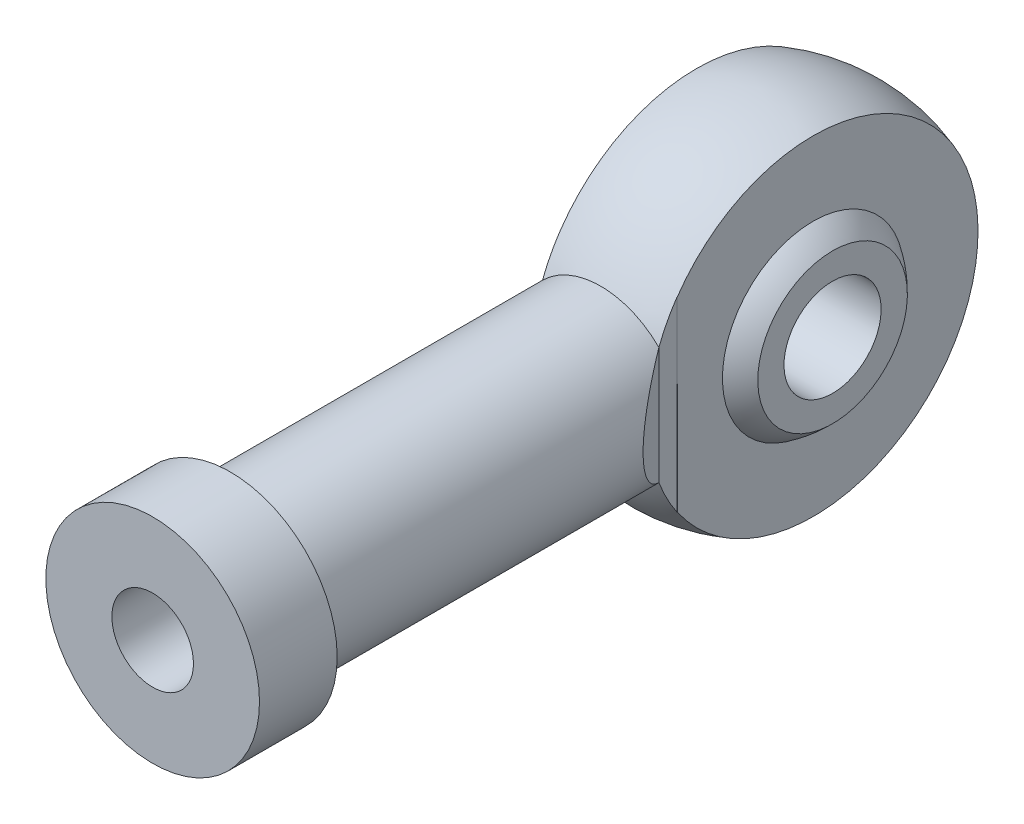
ISO-10303-21;
HEADER;
FILE_DESCRIPTION(('STEP AP214'),'2;1');
FILE_NAME('part.step','',(''),(''),'','','');
FILE_SCHEMA(('AUTOMOTIVE_DESIGN { 1 0 10303 214 1 1 1 1 }'));
ENDSEC;
DATA;
#1=APPLICATION_CONTEXT('core data for automotive mechanical design processes');
#2=APPLICATION_PROTOCOL_DEFINITION('international standard','automotive_design',2000,#1);
#3=PRODUCT_CONTEXT('',#1,'mechanical');
#4=PRODUCT('Part','Part','',(#3));
#5=PRODUCT_RELATED_PRODUCT_CATEGORY('part','',(#4));
#6=PRODUCT_DEFINITION_FORMATION('','',#4);
#7=PRODUCT_DEFINITION_CONTEXT('part definition',#1,'design');
#8=PRODUCT_DEFINITION('design','',#6,#7);
#9=PRODUCT_DEFINITION_SHAPE('','',#8);
#10=(LENGTH_UNIT() NAMED_UNIT(*) SI_UNIT(.MILLI.,.METRE.));
#11=(NAMED_UNIT(*) PLANE_ANGLE_UNIT() SI_UNIT($,.RADIAN.));
#12=(NAMED_UNIT(*) SI_UNIT($,.STERADIAN.) SOLID_ANGLE_UNIT());
#13=UNCERTAINTY_MEASURE_WITH_UNIT(LENGTH_MEASURE(1.E-05),#10,'distance_accuracy_value','');
#14=(GEOMETRIC_REPRESENTATION_CONTEXT(3) GLOBAL_UNCERTAINTY_ASSIGNED_CONTEXT((#13)) GLOBAL_UNIT_ASSIGNED_CONTEXT((#10,
#11,#12)) REPRESENTATION_CONTEXT('',''));
#15=CARTESIAN_POINT('',(0.,0.,0.));
#16=DIRECTION('',(0.,0.,1.));
#17=DIRECTION('',(1.,0.,0.));
#18=AXIS2_PLACEMENT_3D('',#15,#16,#17);
#19=CARTESIAN_POINT('',(-2.99065769581719,-0.00329144068268788,0.));
#20=DIRECTION('',(0.999999394368772,0.00110057352731877,0.));
#21=DIRECTION('',(-0.00110057352731877,0.999999394368772,0.));
#22=AXIS2_PLACEMENT_3D('',#19,#20,#21);
#23=CONICAL_SURFACE('',#22,8.48857795586915,1.5696957530454);
#24=CARTESIAN_POINT('',(-2.98587767050593,-4.50986404126184,6.99999999999999));
#25=CARTESIAN_POINT('',(-2.98696704089088,-3.86904866982626,6.99999999999999));
#26=CARTESIAN_POINT('',(-2.98799511268696,-3.22823318379778,6.99999999999999));
#27=CARTESIAN_POINT('',(-2.98989243643355,-1.94660198497909,6.99999999999999));
#28=CARTESIAN_POINT('',(-2.99076168838577,-1.30578627218888,6.99999999999999));
#29=CARTESIAN_POINT('',(-2.99230514964899,-0.0241547354105878,6.99999999999999));
#30=CARTESIAN_POINT('',(-2.99297935899859,0.616661088577456,6.99999999999999));
#31=CARTESIAN_POINT('',(-2.99413983267879,1.89829290344786,6.99999999999999));
#32=CARTESIAN_POINT('',(-2.99462609700943,2.53910889433022,6.99999999999999));
#33=CARTESIAN_POINT('',(-2.99586836539569,4.4615568562803,6.99999999999999));
#34=CARTESIAN_POINT('',(-2.99640784500371,5.74318896076301,6.99999999999999));
#35=CARTESIAN_POINT('',(-2.99722802226726,8.30645339784344,6.99999999999999));
#36=CARTESIAN_POINT('',(-2.99750871988829,9.58808573044116,6.99999999999999));
#37=CARTESIAN_POINT('',(-2.9981832328712,13.4162925804174,6.99999999999999));
#38=CARTESIAN_POINT('',(-2.99841525848541,15.962867125722,6.99999999999999));
#39=CARTESIAN_POINT('',(-2.99876899653975,21.0560162274157,6.99999999999999));
#40=CARTESIAN_POINT('',(-2.99889070897936,23.6025907838048,6.99999999999999));
#41=CARTESIAN_POINT('',(-2.99908289041489,28.6957384884072,6.99999999999999));
#42=CARTESIAN_POINT('',(-2.99915335943921,31.2423116366205,6.99999999999999));
#43=CARTESIAN_POINT('',(-2.9992675268632,36.3354579145907,6.99999999999999));
#44=CARTESIAN_POINT('',(-2.99931122526307,38.8820310443476,6.99999999999999));
#45=CARTESIAN_POINT('',(-2.99935377470547,41.4286041730237,6.99999999999999));
#46=B_SPLINE_CURVE_WITH_KNOTS('',3,(#24,#25,#26,#27,#28,#29,#30,#31,#32,#33,#34,#35,#36,#37,#38,
#39,#40,#41,#42,#43,#44,#45),.UNSPECIFIED.,.F.,.F.,(4,2,2,2,2,2,2,2,2,2,4),(0.,1.92244890536118,
3.84489779014671,5.76734629436151,7.68979479809854,11.5346913732364,15.3795884611671,
23.0193121075204,30.6590357889017,38.2987552354128,45.9384746246257),.UNSPECIFIED.);
#47=CARTESIAN_POINT('',(-2.99594227764374,4.79836741705207,6.99999999999999));
#48=VERTEX_POINT('',#47);
#49=CARTESIAN_POINT('',(-2.99493247749547,3.01544017603445,6.99999999999999));
#50=VERTEX_POINT('',#49);
#51=EDGE_CURVE('E177',#48,#50,#46,.F.);
#52=ORIENTED_EDGE('',*,*,#51,.F.);
#53=CARTESIAN_POINT('',(-2.99065769581719,-0.00329144068268788,0.));
#54=DIRECTION('',(0.999999394368772,0.00110057352731877,0.));
#55=DIRECTION('',(-0.00110057352731877,0.999999394368772,0.));
#56=AXIS2_PLACEMENT_3D('',#53,#54,#55);
#57=CIRCLE('',#56,8.48857795586915);
#58=CARTESIAN_POINT('',(-2.98733431806022,-3.02296769287065,7.93331582631121));
#59=VERTEX_POINT('',#58);
#60=EDGE_CURVE('E266',#59,#48,#57,.T.);
#61=ORIENTED_EDGE('',*,*,#60,.F.);
#62=CARTESIAN_POINT('',(-2.9866050355156,-3.02368820512844,8.63763575145607));
#63=CARTESIAN_POINT('',(-2.98691527374126,-3.02338176898465,8.33985350291747));
#64=CARTESIAN_POINT('',(-2.98722317419889,-3.02307755174879,8.04207124972971));
#65=CARTESIAN_POINT('',(-2.98783429957813,-3.02247355509293,7.44650673404871));
#66=CARTESIAN_POINT('',(-2.98813752449973,-3.02217377567294,7.14872447155548));
#67=CARTESIAN_POINT('',(-2.98843841165331,-3.02187621516088,6.85094220441308));
#68=B_SPLINE_CURVE_WITH_KNOTS('',3,(#62,#63,#64,#65,#66,#67),.UNSPECIFIED.,.F.,.F.,(4,2,4),(0.,
0.893347703293407,1.78669540660818),.UNSPECIFIED.);
#69=CARTESIAN_POINT('',(-2.98828779895705,-3.02202515386693,6.99999999999999));
#70=VERTEX_POINT('',#69);
#71=EDGE_CURVE('E237',#59,#70,#68,.T.);
#72=ORIENTED_EDGE('',*,*,#71,.T.);
#73=CARTESIAN_POINT('',(-2.97379861716255,-10.877684637419,6.99999999999999));
#74=CARTESIAN_POINT('',(-2.97635712662216,-9.59598682161832,6.99999999999999));
#75=CARTESIAN_POINT('',(-2.97892320568871,-8.31428896298168,6.99999999999999));
#76=CARTESIAN_POINT('',(-2.98376835514571,-5.75089287020575,6.99999999999999));
#77=CARTESIAN_POINT('',(-2.98604742557103,-4.46919463606651,6.99999999999999));
#78=CARTESIAN_POINT('',(-2.99001641095492,-1.9057969773286,6.99999999999999));
#79=CARTESIAN_POINT('',(-2.99170632581525,-0.624097552729756,6.99999999999999));
#80=CARTESIAN_POINT('',(-2.99427185308603,1.93930217772501,6.99999999999999));
#81=CARTESIAN_POINT('',(-2.99514746544313,3.22100248358098,6.99999999999999));
#82=CARTESIAN_POINT('',(-2.99644317077067,5.77771312742276,6.99999999999999));
#83=CARTESIAN_POINT('',(-2.99686561757702,7.05272346450061,6.99999999999999));
#84=CARTESIAN_POINT('',(-2.99752052082259,9.60274419811214,6.99999999999999));
#85=CARTESIAN_POINT('',(-2.99775297725966,10.8777545946458,6.99999999999999));
#86=CARTESIAN_POINT('',(-2.99812778265043,13.4277751853676,6.99999999999999));
#87=CARTESIAN_POINT('',(-2.99827013161921,14.7027853795558,6.99999999999999));
#88=CARTESIAN_POINT('',(-2.99850334633731,17.252805733344,6.99999999999999));
#89=CARTESIAN_POINT('',(-2.99859421208823,18.527815892944,6.99999999999999));
#90=CARTESIAN_POINT('',(-2.99867864833403,19.8028260520173,6.99999999999999));
#91=B_SPLINE_CURVE_WITH_KNOTS('',3,(#73,#74,#75,#76,#77,#78,#79,#80,#81,#82,#83,#84,#85,#86,#87,
#88,#89,#90),.UNSPECIFIED.,.F.,.F.,(4,2,2,2,2,2,2,2,4),(0.,3.84510120546921,7.69020194382671,
11.5353033233419,15.3804049547153,19.2054361569159,23.0304674025207,26.8554980081179,
30.6805284950457),.UNSPECIFIED.);
#92=EDGE_CURVE('E220',#50,#70,#91,.F.);
#93=ORIENTED_EDGE('',*,*,#92,.F.);
#94=EDGE_LOOP('',(#52,#61,#72,#93));
#95=FACE_BOUND('',#94,.T.);
#96=CARTESIAN_POINT('',(-2.99485090559737,-0.00329605562116139,0.));
#97=DIRECTION('',(0.999999394368772,0.00110057352731877,0.));
#98=DIRECTION('',(-0.00110057352731877,0.999999394368772,0.));
#99=AXIS2_PLACEMENT_3D('',#96,#97,#98);
#100=CIRCLE('',#99,4.67855556654615);
#101=CARTESIAN_POINT('',(-3.,4.67525667744564,0.));
#102=VERTEX_POINT('',#101);
#103=EDGE_CURVE('E272',#102,#102,#100,.T.);
#104=ORIENTED_EDGE('',*,*,#103,.T.);
#105=EDGE_LOOP('',(#104));
#106=FACE_BOUND('',#105,.T.);
#107=ADVANCED_FACE('F38',(#95,#106),#23,.T.);
#108=CARTESIAN_POINT('',(3.0051418268301,0.00330738154350106,0.));
#109=DIRECTION('',(0.999999394368772,0.00110057352731877,0.));
#110=DIRECTION('',(-0.00110057352731877,0.999999394368772,0.));
#111=AXIS2_PLACEMENT_3D('',#108,#109,#110);
#112=CONICAL_SURFACE('',#111,4.67195212538224,1.5696957530454);
#113=CARTESIAN_POINT('',(3.04026645925843,-17.6204222066128,6.99999999999999));
#114=CARTESIAN_POINT('',(3.03788491929923,-16.4970888417773,6.99999999999999));
#115=CARTESIAN_POINT('',(3.03551138726321,-15.3737554581972,6.99999999999999));
#116=CARTESIAN_POINT('',(3.03081708698999,-13.12708846677,6.99999999999999));
#117=CARTESIAN_POINT('',(3.02849631875816,-12.003754858923,6.99999999999999));
#118=CARTESIAN_POINT('',(3.02362250544488,-9.59826732993797,6.99999999999999));
#119=CARTESIAN_POINT('',(3.0210830104967,-8.31611338118396,6.99999999999999));
#120=CARTESIAN_POINT('',(3.01625541273942,-5.7518050809759,6.99999999999999));
#121=CARTESIAN_POINT('',(3.01396730991322,-4.46965072952189,6.99999999999999));
#122=CARTESIAN_POINT('',(3.00998941226899,-1.90534084194531,6.99999999999999));
#123=CARTESIAN_POINT('',(3.00829961754285,-0.623185305822602,6.99999999999999));
#124=CARTESIAN_POINT('',(3.00573264791389,1.94112661206625,6.99999999999999));
#125=CARTESIAN_POINT('',(3.00485547304258,3.22328299383242,6.99999999999999));
#126=CARTESIAN_POINT('',(3.00355803207283,5.78044955937465,6.99999999999999));
#127=CARTESIAN_POINT('',(3.0031352465461,7.05545974217479,6.99999999999999));
#128=CARTESIAN_POINT('',(3.00248061087516,9.60548016187929,6.99999999999999));
#129=CARTESIAN_POINT('',(3.00224876073232,10.8804903987837,6.99999999999999));
#130=CARTESIAN_POINT('',(3.00168304274492,14.7055212393151,6.99999999999999));
#131=CARTESIAN_POINT('',(3.00147900737371,17.2555418590416,6.99999999999999));
#132=CARTESIAN_POINT('',(3.00118256639453,22.0577715207377,6.99999999999999));
#133=CARTESIAN_POINT('',(3.00107990670306,24.3099805624441,6.99999999999999));
#134=CARTESIAN_POINT('',(3.00091651603292,28.8143984707163,6.99999999999999));
#135=CARTESIAN_POINT('',(3.00085578505095,31.0666073372821,6.99999999999999));
#136=CARTESIAN_POINT('',(3.00080061391159,33.3188162045301,6.99999999999999));
#137=B_SPLINE_CURVE_WITH_KNOTS('',3,(#113,#114,#115,#116,#117,#118,#119,#120,#121,#122,#123,
#124,#125,#126,#127,#128,#129,#130,#131,#132,#133,#134,#135,#136),.UNSPECIFIED.,.F.,.F.,(4,2,2,
2,2,2,2,2,2,2,2,4),(0.,3.37000767087777,6.74001568467636,10.5864850689445,14.4329541915297,
18.2794239047968,22.1258937672008,25.9509245063626,29.7759552730669,37.4260171476329,
44.1826442803645,50.9392708828254),.UNSPECIFIED.);
#138=CARTESIAN_POINT('',(3.01460675987241,-4.78666335596433,6.99999999999999));
#139=VERTEX_POINT('',#138);
#140=CARTESIAN_POINT('',(3.00406331334815,4.79328734892828,6.99999999999999));
#141=VERTEX_POINT('',#140);
#142=EDGE_CURVE('E197',#139,#141,#137,.T.);
#143=ORIENTED_EDGE('',*,*,#142,.F.);
#144=CARTESIAN_POINT('',(3.00933503661028,0.00331199648197457,0.));
#145=DIRECTION('',(0.999999394368772,0.00110057352731877,0.));
#146=DIRECTION('',(-0.00110057352731877,0.999999394368772,0.));
#147=AXIS2_PLACEMENT_3D('',#144,#145,#146);
#148=CIRCLE('',#147,8.48197451470523);
#149=EDGE_CURVE('E267',#139,#141,#148,.T.);
#150=ORIENTED_EDGE('',*,*,#149,.T.);
#151=EDGE_LOOP('',(#143,#150));
#152=FACE_BOUND('',#151,.T.);
#153=CARTESIAN_POINT('',(3.0051418268301,0.00330738154350106,0.));
#154=DIRECTION('',(0.999999394368772,0.00110057352731877,0.));
#155=DIRECTION('',(-0.00110057352731877,0.999999394368772,0.));
#156=AXIS2_PLACEMENT_3D('',#153,#154,#155);
#157=CIRCLE('',#156,4.67195212538224);
#158=CARTESIAN_POINT('',(3.,4.67525667744564,0.));
#159=VERTEX_POINT('',#158);
#160=EDGE_CURVE('E270',#159,#159,#157,.T.);
#161=ORIENTED_EDGE('',*,*,#160,.F.);
#162=EDGE_LOOP('',(#161));
#163=FACE_BOUND('',#162,.T.);
#164=ADVANCED_FACE('F207',(#152,#163),#112,.F.);
#165=CARTESIAN_POINT('',(0.,0.,0.));
#166=DIRECTION('',(0.999999394368772,0.00110057352731877,0.));
#167=DIRECTION('',(-0.00110057352731877,0.999999394368772,0.));
#168=AXIS2_PLACEMENT_3D('',#165,#166,#167);
#169=SPHERICAL_SURFACE('',#168,9.);
#170=CARTESIAN_POINT('',(2.99493247749547,0.,0.));
#171=DIRECTION('',(-1.,0.,0.));
#172=DIRECTION('',(0.,0.,1.));
#173=AXIS2_PLACEMENT_3D('',#170,#171,#172);
#174=CIRCLE('',#173,8.48707131201587);
#175=CARTESIAN_POINT('',(2.99493247749547,-3.01544017603448,7.93331582631121));
#176=VERTEX_POINT('',#175);
#177=CARTESIAN_POINT('',(2.99493247749547,-4.7989977552863,6.99999999999999));
#178=VERTEX_POINT('',#177);
#179=EDGE_CURVE('E132',#176,#178,#174,.F.);
#180=ORIENTED_EDGE('',*,*,#179,.F.);
#181=CARTESIAN_POINT('',(0.,0.,7.93331582631121));
#182=DIRECTION('',(0.,0.,-1.));
#183=DIRECTION('',(-1.,0.,0.));
#184=AXIS2_PLACEMENT_3D('',#181,#182,#183);
#185=CIRCLE('',#184,4.25);
#186=EDGE_CURVE('E61',#176,#59,#185,.T.);
#187=ORIENTED_EDGE('',*,*,#186,.T.);
#188=ORIENTED_EDGE('',*,*,#60,.T.);
#189=CARTESIAN_POINT('',(0.,0.,6.99999999999999));
#190=DIRECTION('',(0.,0.,-1.));
#191=DIRECTION('',(-1.,0.,0.));
#192=AXIS2_PLACEMENT_3D('',#189,#190,#191);
#193=CIRCLE('',#192,5.65685424949239);
#194=CARTESIAN_POINT('',(-2.99493247749547,4.79899775528629,6.99999999999999));
#195=VERTEX_POINT('',#194);
#196=EDGE_CURVE('E183',#195,#48,#193,.F.);
#197=ORIENTED_EDGE('',*,*,#196,.F.);
#198=CARTESIAN_POINT('',(-2.99493247749547,0.,0.));
#199=DIRECTION('',(1.,0.,0.));
#200=DIRECTION('',(0.,0.,-1.));
#201=AXIS2_PLACEMENT_3D('',#198,#199,#200);
#202=CIRCLE('',#201,8.48707131201587);
#203=CARTESIAN_POINT('',(-2.99493247749547,3.880846223209,7.54780842675849));
#204=VERTEX_POINT('',#203);
#205=EDGE_CURVE('E151',#204,#195,#202,.F.);
#206=ORIENTED_EDGE('',*,*,#205,.F.);
#207=CARTESIAN_POINT('',(-2.99398107357416,3.01638481150527,7.93331582631121));
#208=VERTEX_POINT('',#207);
#209=EDGE_CURVE('E262',#204,#208,#57,.T.);
#210=ORIENTED_EDGE('',*,*,#209,.T.);
#211=CARTESIAN_POINT('',(2.99493247749547,3.01544017603447,7.93331582631121));
#212=VERTEX_POINT('',#211);
#213=EDGE_CURVE('E205',#208,#212,#185,.T.);
#214=ORIENTED_EDGE('',*,*,#213,.T.);
#215=CARTESIAN_POINT('',(2.99493247749547,4.7989977552863,6.99999999999999));
#216=VERTEX_POINT('',#215);
#217=EDGE_CURVE('E129',#216,#212,#174,.F.);
#218=ORIENTED_EDGE('',*,*,#217,.F.);
#219=CARTESIAN_POINT('',(0.,0.,6.99999999999999));
#220=DIRECTION('',(0.,0.,-1.));
#221=DIRECTION('',(-1.,0.,0.));
#222=AXIS2_PLACEMENT_3D('',#219,#220,#221);
#223=CIRCLE('',#222,5.65685424949239);
#224=EDGE_CURVE('E125',#141,#216,#223,.F.);
#225=ORIENTED_EDGE('',*,*,#224,.F.);
#226=ORIENTED_EDGE('',*,*,#149,.F.);
#227=EDGE_CURVE('E128',#178,#139,#223,.F.);
#228=ORIENTED_EDGE('',*,*,#227,.F.);
#229=EDGE_LOOP('',(#180,#187,#188,#197,#206,#210,#214,#218,#225,#226,#228));
#230=FACE_BOUND('',#229,.T.);
#231=ADVANCED_FACE('F265',(#230),#169,.T.);
#232=CARTESIAN_POINT('',(-2.99493247749547,0.744253087145943,5.29952192812903));
#233=CARTESIAN_POINT('',(-2.99493247749547,1.43164348018067,5.88803603499139));
#234=CARTESIAN_POINT('',(-2.99493247749547,2.15571924505364,6.42683335695496));
#235=CARTESIAN_POINT('',(-2.99493247749547,3.65184621188483,7.42548632285628));
#236=CARTESIAN_POINT('',(-2.99493247749547,4.42364261510994,7.88571896370447));
#237=CARTESIAN_POINT('',(-2.99493247749547,6.05180612930398,8.78328964114072));
#238=CARTESIAN_POINT('',(-2.99493247749547,6.91032027005502,9.21680330450003));
#239=CARTESIAN_POINT('',(-2.99493247749547,7.77280817402642,9.63379389818218));
#240=B_SPLINE_CURVE_WITH_KNOTS('',3,(#232,#233,#234,#235,#236,#237,#238,#239),.UNSPECIFIED.,.F.,
.F.,(4,2,2,4),(0.,2.70583672149586,5.39830022826054,8.27820465081111),.UNSPECIFIED.);
#241=EDGE_CURVE('E143',#50,#204,#240,.T.);
#242=ORIENTED_EDGE('',*,*,#241,.F.);
#243=CARTESIAN_POINT('',(-2.99508276199107,3.01529090616874,6.85094220441308));
#244=CARTESIAN_POINT('',(-2.99478253054045,3.01558912825643,7.14872447155548));
#245=CARTESIAN_POINT('',(-2.9944799662116,3.01588957439244,7.44650673404871));
#246=CARTESIAN_POINT('',(-2.99387017179748,3.01649491476112,8.04207124972971));
#247=CARTESIAN_POINT('',(-2.99356294171221,3.01679980899378,8.33985350291748));
#248=CARTESIAN_POINT('',(-2.99325337874872,3.01710692727476,8.63763575145607));
#249=B_SPLINE_CURVE_WITH_KNOTS('',3,(#243,#244,#245,#246,#247,#248),.UNSPECIFIED.,.F.,.F.,(4,2,
4),(0.,0.893347703314771,1.78669540660818),.UNSPECIFIED.);
#250=EDGE_CURVE('E228',#50,#208,#249,.T.);
#251=ORIENTED_EDGE('',*,*,#250,.T.);
#252=ORIENTED_EDGE('',*,*,#209,.F.);
#253=EDGE_LOOP('',(#242,#251,#252));
#254=FACE_BOUND('',#253,.T.);
#255=ADVANCED_FACE('F153',(#254),#23,.T.);
#256=CARTESIAN_POINT('',(0.,0.,0.));
#257=DIRECTION('',(0.999999394368772,0.00110057352731877,0.));
#258=DIRECTION('',(-0.00110057352731877,0.999999394368772,0.));
#259=AXIS2_PLACEMENT_3D('',#256,#257,#258);
#260=SPHERICAL_SURFACE('',#259,5.555);
#261=CARTESIAN_POINT('',(-3.99575287483343,-0.00439762249908713,0.));
#262=DIRECTION('',(0.999999394368772,0.00110057352731877,0.));
#263=DIRECTION('',(-0.00110057352731877,0.999999394368772,0.));
#264=AXIS2_PLACEMENT_3D('',#261,#262,#263);
#265=CIRCLE('',#264,3.85901083493902);
#266=CARTESIAN_POINT('',(-4.,3.85461087530246,0.));
#267=VERTEX_POINT('',#266);
#268=EDGE_CURVE('E229',#267,#267,#265,.T.);
#269=ORIENTED_EDGE('',*,*,#268,.T.);
#270=EDGE_LOOP('',(#269));
#271=FACE_BOUND('',#270,.T.);
#272=ORIENTED_EDGE('',*,*,#103,.F.);
#273=EDGE_LOOP('',(#272));
#274=FACE_BOUND('',#273,.T.);
#275=ADVANCED_FACE('F40',(#271,#274),#260,.T.);
#276=CARTESIAN_POINT('',(-3.99575287483343,-0.00439762249908713,0.));
#277=DIRECTION('',(0.999999394368772,0.00110057352731877,0.));
#278=DIRECTION('',(-0.00110057352731877,0.999999394368772,0.));
#279=AXIS2_PLACEMENT_3D('',#276,#277,#278);
#280=CONICAL_SURFACE('',#279,3.85901083493902,1.56969575304539);
#281=CARTESIAN_POINT('',(-3.99724856618171,-0.00439926861838702,0.));
#282=DIRECTION('',(0.999999394368772,0.00110057352731877,0.));
#283=DIRECTION('',(-0.00110057352731877,0.999999394368772,0.));
#284=AXIS2_PLACEMENT_3D('',#281,#282,#283);
#285=CIRCLE('',#284,2.5);
#286=CARTESIAN_POINT('',(-4.,2.49559921730354,0.));
#287=VERTEX_POINT('',#286);
#288=EDGE_CURVE('E281',#287,#287,#285,.T.);
#289=ORIENTED_EDGE('',*,*,#288,.T.);
#290=EDGE_LOOP('',(#289));
#291=FACE_BOUND('',#290,.T.);
#292=ORIENTED_EDGE('',*,*,#268,.F.);
#293=EDGE_LOOP('',(#292));
#294=FACE_BOUND('',#293,.T.);
#295=ADVANCED_FACE('F290',(#291,#294),#280,.T.);
#296=CARTESIAN_POINT('',(3.99999515495165,0.00440229144310824,0.));
#297=DIRECTION('',(0.999999394368772,0.00110057352731877,0.));
#298=DIRECTION('',(-0.00110057352731877,0.999999394368772,0.));
#299=AXIS2_PLACEMENT_3D('',#296,#297,#298);
#300=CYLINDRICAL_SURFACE('',#299,2.5);
#301=CARTESIAN_POINT('',(4.0027514338183,0.00440532493249996,0.));
#302=DIRECTION('',(0.999999394368772,0.00110057352731877,0.));
#303=DIRECTION('',(-0.00110057352731877,0.999999394368772,0.));
#304=AXIS2_PLACEMENT_3D('',#301,#302,#303);
#305=CIRCLE('',#304,2.5);
#306=CARTESIAN_POINT('',(4.,2.50440381085443,0.));
#307=VERTEX_POINT('',#306);
#308=EDGE_CURVE('E279',#307,#307,#305,.T.);
#309=ORIENTED_EDGE('',*,*,#308,.T.);
#310=EDGE_LOOP('',(#309));
#311=FACE_BOUND('',#310,.T.);
#312=ORIENTED_EDGE('',*,*,#288,.F.);
#313=EDGE_LOOP('',(#312));
#314=FACE_BOUND('',#313,.T.);
#315=ADVANCED_FACE('F292',(#311,#314),#300,.F.);
#316=CARTESIAN_POINT('',(4.0027514338183,0.00440532493249996,0.));
#317=DIRECTION('',(0.999999394368772,0.00110057352731877,0.));
#318=DIRECTION('',(-0.00110057352731877,0.999999394368772,0.));
#319=AXIS2_PLACEMENT_3D('',#316,#317,#318);
#320=CONICAL_SURFACE('',#319,2.5,1.5696957530454);
#321=CARTESIAN_POINT('',(4.00423743506986,0.00440696038712947,0.));
#322=DIRECTION('',(0.999999394368772,0.00110057352731877,0.));
#323=DIRECTION('',(-0.00110057352731877,0.999999394368772,0.));
#324=AXIS2_PLACEMENT_3D('',#321,#322,#323);
#325=CIRCLE('',#324,3.85020624672047);
#326=CARTESIAN_POINT('',(4.,3.85461087530246,0.));
#327=VERTEX_POINT('',#326);
#328=EDGE_CURVE('E276',#327,#327,#325,.T.);
#329=ORIENTED_EDGE('',*,*,#328,.T.);
#330=EDGE_LOOP('',(#329));
#331=FACE_BOUND('',#330,.T.);
#332=ORIENTED_EDGE('',*,*,#308,.F.);
#333=EDGE_LOOP('',(#332));
#334=FACE_BOUND('',#333,.T.);
#335=ADVANCED_FACE('F297',(#331,#334),#320,.F.);
#336=CARTESIAN_POINT('',(0.,0.,0.));
#337=DIRECTION('',(0.999999394368772,0.00110057352731877,0.));
#338=DIRECTION('',(-0.00110057352731877,0.999999394368772,0.));
#339=AXIS2_PLACEMENT_3D('',#336,#337,#338);
#340=SPHERICAL_SURFACE('',#339,5.555);
#341=ORIENTED_EDGE('',*,*,#160,.T.);
#342=EDGE_LOOP('',(#341));
#343=FACE_BOUND('',#342,.T.);
#344=ORIENTED_EDGE('',*,*,#328,.F.);
#345=EDGE_LOOP('',(#344));
#346=FACE_BOUND('',#345,.T.);
#347=ADVANCED_FACE('F345',(#343,#346),#340,.T.);
#348=CARTESIAN_POINT('',(0.,0.,6.99999999999999));
#349=DIRECTION('',(0.,0.,1.));
#350=DIRECTION('',(1.,0.,0.));
#351=AXIS2_PLACEMENT_3D('',#348,#349,#350);
#352=CYLINDRICAL_SURFACE('',#351,4.25);
#353=CARTESIAN_POINT('',(0.,0.,3.00164526554736));
#354=DIRECTION('',(-0.854733389196251,0.,0.519067272512042));
#355=DIRECTION('',(0.519067272512042,0.,0.854733389196251));
#356=AXIS2_PLACEMENT_3D('',#353,#354,#355);
#357=ELLIPSE('',#356,8.18776336915251,4.25);
#358=EDGE_CURVE('E11',#176,#212,#357,.T.);
#359=ORIENTED_EDGE('',*,*,#358,.T.);
#360=ORIENTED_EDGE('',*,*,#213,.F.);
#361=ORIENTED_EDGE('',*,*,#250,.F.);
#362=DIRECTION('',(0.,0.,1.));
#363=VECTOR('',#362,1.);
#364=CARTESIAN_POINT('',(-2.99493247749547,3.01544017603448,6.99999999999999));
#365=LINE('',#364,#363);
#366=CARTESIAN_POINT('',(-2.99493247749547,3.01544017603447,7.93331582631121));
#367=VERTEX_POINT('',#366);
#368=EDGE_CURVE('E140',#50,#367,#365,.T.);
#369=ORIENTED_EDGE('',*,*,#368,.T.);
#370=CARTESIAN_POINT('',(0.,0.,3.00164526554736));
#371=DIRECTION('',(0.854733389196251,0.,0.519067272512042));
#372=DIRECTION('',(-0.519067272512042,0.,0.854733389196251));
#373=AXIS2_PLACEMENT_3D('',#370,#371,#372);
#374=ELLIPSE('',#373,8.18776336915251,4.25);
#375=CARTESIAN_POINT('',(-2.99493247749547,-3.01544017603448,7.93331582631121));
#376=VERTEX_POINT('',#375);
#377=EDGE_CURVE('E46',#367,#376,#374,.T.);
#378=ORIENTED_EDGE('',*,*,#377,.T.);
#379=DIRECTION('',(0.,0.,1.));
#380=VECTOR('',#379,1.);
#381=CARTESIAN_POINT('',(-2.99493247749547,-3.01544017603448,6.99999999999999));
#382=LINE('',#381,#380);
#383=CARTESIAN_POINT('',(-2.99493247749547,-3.01544017603448,6.99999999999999));
#384=VERTEX_POINT('',#383);
#385=EDGE_CURVE('E134',#376,#384,#382,.F.);
#386=ORIENTED_EDGE('',*,*,#385,.T.);
#387=CARTESIAN_POINT('',(0.,0.,6.99999999999999));
#388=DIRECTION('',(0.,0.,-1.));
#389=DIRECTION('',(-1.,0.,0.));
#390=AXIS2_PLACEMENT_3D('',#387,#388,#389);
#391=CIRCLE('',#390,4.25);
#392=EDGE_CURVE('E194',#70,#384,#391,.T.);
#393=ORIENTED_EDGE('',*,*,#392,.F.);
#394=ORIENTED_EDGE('',*,*,#71,.F.);
#395=ORIENTED_EDGE('',*,*,#186,.F.);
#396=EDGE_LOOP('',(#359,#360,#361,#369,#378,#386,#393,#394,#395));
#397=FACE_BOUND('',#396,.T.);
#398=CARTESIAN_POINT('',(0.,0.,27.));
#399=DIRECTION('',(0.,0.,1.));
#400=DIRECTION('',(1.,0.,0.));
#401=AXIS2_PLACEMENT_3D('',#398,#399,#400);
#402=CIRCLE('',#401,4.25);
#403=CARTESIAN_POINT('',(4.25,0.,27.));
#404=VERTEX_POINT('',#403);
#405=EDGE_CURVE('E189',#404,#404,#402,.T.);
#406=ORIENTED_EDGE('',*,*,#405,.F.);
#407=EDGE_LOOP('',(#406));
#408=FACE_BOUND('',#407,.T.);
#409=ADVANCED_FACE('F215',(#397,#408),#352,.T.);
#410=CARTESIAN_POINT('',(0.,0.,6.99999999999999));
#411=DIRECTION('',(0.,0.,-1.));
#412=DIRECTION('',(-1.,0.,0.));
#413=AXIS2_PLACEMENT_3D('',#410,#411,#412);
#414=PLANE('',#413);
#415=DIRECTION('',(0.,-1.,0.));
#416=VECTOR('',#415,1.);
#417=CARTESIAN_POINT('',(-2.99493247749547,0.,6.99999999999999));
#418=LINE('',#417,#416);
#419=EDGE_CURVE('E243',#50,#384,#418,.T.);
#420=ORIENTED_EDGE('',*,*,#419,.F.);
#421=ORIENTED_EDGE('',*,*,#92,.T.);
#422=ORIENTED_EDGE('',*,*,#392,.T.);
#423=EDGE_LOOP('',(#420,#421,#422));
#424=FACE_BOUND('',#423,.T.);
#425=ADVANCED_FACE('F210',(#424),#414,.T.);
#426=CARTESIAN_POINT('',(0.,0.,31.));
#427=DIRECTION('',(0.,0.,-1.));
#428=DIRECTION('',(-1.,0.,0.));
#429=AXIS2_PLACEMENT_3D('',#426,#427,#428);
#430=CYLINDRICAL_SURFACE('',#429,5.5);
#431=CARTESIAN_POINT('',(0.,0.,31.));
#432=DIRECTION('',(0.,0.,1.));
#433=DIRECTION('',(1.,0.,0.));
#434=AXIS2_PLACEMENT_3D('',#431,#432,#433);
#435=CIRCLE('',#434,5.5);
#436=CARTESIAN_POINT('',(5.5,0.,31.));
#437=VERTEX_POINT('',#436);
#438=EDGE_CURVE('E186',#437,#437,#435,.T.);
#439=ORIENTED_EDGE('',*,*,#438,.F.);
#440=EDGE_LOOP('',(#439));
#441=FACE_BOUND('',#440,.T.);
#442=CARTESIAN_POINT('',(0.,0.,27.));
#443=DIRECTION('',(0.,0.,1.));
#444=DIRECTION('',(1.,0.,0.));
#445=AXIS2_PLACEMENT_3D('',#442,#443,#444);
#446=CIRCLE('',#445,5.5);
#447=CARTESIAN_POINT('',(5.5,0.,27.));
#448=VERTEX_POINT('',#447);
#449=EDGE_CURVE('E185',#448,#448,#446,.T.);
#450=ORIENTED_EDGE('',*,*,#449,.T.);
#451=EDGE_LOOP('',(#450));
#452=FACE_BOUND('',#451,.T.);
#453=ADVANCED_FACE('F214',(#441,#452),#430,.T.);
#454=CARTESIAN_POINT('',(0.,0.,31.));
#455=DIRECTION('',(0.,0.,1.));
#456=DIRECTION('',(1.,0.,0.));
#457=AXIS2_PLACEMENT_3D('',#454,#455,#456);
#458=PLANE('',#457);
#459=CARTESIAN_POINT('',(0.,0.,31.));
#460=DIRECTION('',(0.,0.,1.));
#461=DIRECTION('',(1.,0.,0.));
#462=AXIS2_PLACEMENT_3D('',#459,#460,#461);
#463=CIRCLE('',#462,2.09999999999999);
#464=CARTESIAN_POINT('',(2.09999999999999,0.,31.));
#465=VERTEX_POINT('',#464);
#466=EDGE_CURVE('E116',#465,#465,#463,.T.);
#467=ORIENTED_EDGE('',*,*,#466,.F.);
#468=EDGE_LOOP('',(#467));
#469=FACE_BOUND('',#468,.T.);
#470=ORIENTED_EDGE('',*,*,#438,.T.);
#471=EDGE_LOOP('',(#470));
#472=FACE_BOUND('',#471,.T.);
#473=ADVANCED_FACE('F175',(#469,#472),#458,.T.);
#474=CARTESIAN_POINT('',(0.,0.,27.));
#475=DIRECTION('',(0.,0.,1.));
#476=DIRECTION('',(1.,0.,0.));
#477=AXIS2_PLACEMENT_3D('',#474,#475,#476);
#478=PLANE('',#477);
#479=ORIENTED_EDGE('',*,*,#405,.T.);
#480=EDGE_LOOP('',(#479));
#481=FACE_BOUND('',#480,.T.);
#482=ORIENTED_EDGE('',*,*,#449,.F.);
#483=EDGE_LOOP('',(#482));
#484=FACE_BOUND('',#483,.T.);
#485=ADVANCED_FACE('F163',(#481,#484),#478,.F.);
#486=CARTESIAN_POINT('',(-2.99493247749547,-10.,6.99999999999999));
#487=DIRECTION('',(1.,0.,0.));
#488=DIRECTION('',(0.,0.,-1.));
#489=AXIS2_PLACEMENT_3D('',#486,#487,#488);
#490=PLANE('',#489);
#491=ORIENTED_EDGE('',*,*,#419,.T.);
#492=ORIENTED_EDGE('',*,*,#385,.F.);
#493=DIRECTION('',(0.,1.,0.));
#494=VECTOR('',#493,1.);
#495=CARTESIAN_POINT('',(-2.99493247749547,-10.,7.93331582631121));
#496=LINE('',#495,#494);
#497=EDGE_CURVE('E135',#376,#367,#496,.T.);
#498=ORIENTED_EDGE('',*,*,#497,.T.);
#499=ORIENTED_EDGE('',*,*,#368,.F.);
#500=EDGE_LOOP('',(#491,#492,#498,#499));
#501=FACE_BOUND('',#500,.T.);
#502=ADVANCED_FACE('F157',(#501),#490,.F.);
#503=CARTESIAN_POINT('',(-2.99493247749547,-10.,7.93331582631121));
#504=DIRECTION('',(0.854733389196251,0.,0.519067272512042));
#505=DIRECTION('',(0.519067272512042,0.,-0.854733389196251));
#506=AXIS2_PLACEMENT_3D('',#503,#504,#505);
#507=PLANE('',#506);
#508=ORIENTED_EDGE('',*,*,#377,.F.);
#509=ORIENTED_EDGE('',*,*,#497,.F.);
#510=EDGE_LOOP('',(#508,#509));
#511=FACE_BOUND('',#510,.T.);
#512=ADVANCED_FACE('F162',(#511),#507,.F.);
#513=CARTESIAN_POINT('',(-4.25,-10.,6.99999999999999));
#514=DIRECTION('',(0.,0.,-1.));
#515=DIRECTION('',(-1.,0.,0.));
#516=AXIS2_PLACEMENT_3D('',#513,#514,#515);
#517=PLANE('',#516);
#518=ORIENTED_EDGE('',*,*,#196,.T.);
#519=ORIENTED_EDGE('',*,*,#51,.T.);
#520=DIRECTION('',(0.,1.,0.));
#521=VECTOR('',#520,1.);
#522=CARTESIAN_POINT('',(-2.99493247749547,-10.,6.99999999999999));
#523=LINE('',#522,#521);
#524=EDGE_CURVE('E53',#50,#195,#523,.T.);
#525=ORIENTED_EDGE('',*,*,#524,.T.);
#526=EDGE_LOOP('',(#518,#519,#525));
#527=FACE_BOUND('',#526,.T.);
#528=ADVANCED_FACE('F169',(#527),#517,.F.);
#529=ORIENTED_EDGE('',*,*,#205,.T.);
#530=ORIENTED_EDGE('',*,*,#524,.F.);
#531=ORIENTED_EDGE('',*,*,#241,.T.);
#532=EDGE_LOOP('',(#529,#530,#531));
#533=FACE_BOUND('',#532,.T.);
#534=ADVANCED_FACE('F165',(#533),#490,.F.);
#535=CARTESIAN_POINT('',(2.99493247749547,-10.,7.93331582631121));
#536=DIRECTION('',(-0.854733389196251,0.,0.519067272512042));
#537=DIRECTION('',(0.519067272512042,0.,0.854733389196251));
#538=AXIS2_PLACEMENT_3D('',#535,#536,#537);
#539=PLANE('',#538);
#540=ORIENTED_EDGE('',*,*,#358,.F.);
#541=DIRECTION('',(0.,1.,0.));
#542=VECTOR('',#541,1.);
#543=CARTESIAN_POINT('',(2.99493247749547,-10.,7.93331582631121));
#544=LINE('',#543,#542);
#545=EDGE_CURVE('E119',#176,#212,#544,.T.);
#546=ORIENTED_EDGE('',*,*,#545,.T.);
#547=EDGE_LOOP('',(#540,#546));
#548=FACE_BOUND('',#547,.T.);
#549=ADVANCED_FACE('F415',(#548),#539,.F.);
#550=CARTESIAN_POINT('',(2.99493247749547,-10.,6.99999999999999));
#551=DIRECTION('',(-1.,0.,0.));
#552=DIRECTION('',(0.,0.,1.));
#553=AXIS2_PLACEMENT_3D('',#550,#551,#552);
#554=PLANE('',#553);
#555=ORIENTED_EDGE('',*,*,#179,.T.);
#556=DIRECTION('',(0.,1.,0.));
#557=VECTOR('',#556,1.);
#558=CARTESIAN_POINT('',(2.99493247749547,-10.,6.99999999999999));
#559=LINE('',#558,#557);
#560=EDGE_CURVE('E115',#178,#216,#559,.T.);
#561=ORIENTED_EDGE('',*,*,#560,.T.);
#562=ORIENTED_EDGE('',*,*,#217,.T.);
#563=ORIENTED_EDGE('',*,*,#545,.F.);
#564=EDGE_LOOP('',(#555,#561,#562,#563));
#565=FACE_BOUND('',#564,.T.);
#566=ADVANCED_FACE('F423',(#565),#554,.F.);
#567=CARTESIAN_POINT('',(4.25,-10.,6.99999999999999));
#568=DIRECTION('',(0.,0.,-1.));
#569=DIRECTION('',(-1.,0.,0.));
#570=AXIS2_PLACEMENT_3D('',#567,#568,#569);
#571=PLANE('',#570);
#572=ORIENTED_EDGE('',*,*,#227,.T.);
#573=ORIENTED_EDGE('',*,*,#142,.T.);
#574=ORIENTED_EDGE('',*,*,#224,.T.);
#575=ORIENTED_EDGE('',*,*,#560,.F.);
#576=EDGE_LOOP('',(#572,#573,#574,#575));
#577=FACE_BOUND('',#576,.T.);
#578=ADVANCED_FACE('F109',(#577),#571,.F.);
#579=CARTESIAN_POINT('',(0.,0.,18.6));
#580=DIRECTION('',(0.,0.,1.));
#581=DIRECTION('',(1.,0.,0.));
#582=AXIS2_PLACEMENT_3D('',#579,#580,#581);
#583=CONICAL_SURFACE('',#582,2.09999999999999,1.02974425867665);
#584=CARTESIAN_POINT('',(0.,0.,17.3381927000421));
#585=VERTEX_POINT('',#584);
#586=VERTEX_LOOP('',#585);
#587=FACE_BOUND('',#586,.T.);
#588=CARTESIAN_POINT('',(0.,0.,18.6));
#589=DIRECTION('',(0.,0.,1.));
#590=DIRECTION('',(1.,0.,0.));
#591=AXIS2_PLACEMENT_3D('',#588,#589,#590);
#592=CIRCLE('',#591,2.09999999999999);
#593=CARTESIAN_POINT('',(2.09999999999999,0.,18.6));
#594=VERTEX_POINT('',#593);
#595=EDGE_CURVE('E113',#594,#594,#592,.T.);
#596=ORIENTED_EDGE('',*,*,#595,.T.);
#597=EDGE_LOOP('',(#596));
#598=FACE_BOUND('',#597,.T.);
#599=ADVANCED_FACE('F105',(#587,#598),#583,.F.);
#600=CARTESIAN_POINT('',(0.,0.,31.));
#601=DIRECTION('',(0.,0.,1.));
#602=DIRECTION('',(1.,0.,0.));
#603=AXIS2_PLACEMENT_3D('',#600,#601,#602);
#604=CYLINDRICAL_SURFACE('',#603,2.09999999999999);
#605=ORIENTED_EDGE('',*,*,#595,.F.);
#606=EDGE_LOOP('',(#605));
#607=FACE_BOUND('',#606,.T.);
#608=ORIENTED_EDGE('',*,*,#466,.T.);
#609=EDGE_LOOP('',(#608));
#610=FACE_BOUND('',#609,.T.);
#611=ADVANCED_FACE('F108',(#607,#610),#604,.F.);
#612=CLOSED_SHELL('',(#107,#164,#231,#255,#275,#295,#315,#335,#347,#409,#425,#453,#473,#485,
#502,#512,#528,#534,#549,#566,#578,#599,#611));
#613=MANIFOLD_SOLID_BREP('B2',#612);
#614=ADVANCED_BREP_SHAPE_REPRESENTATION('',(#18,#613),#14);
#615=SHAPE_DEFINITION_REPRESENTATION(#9,#614);
ENDSEC;
END-ISO-10303-21;
